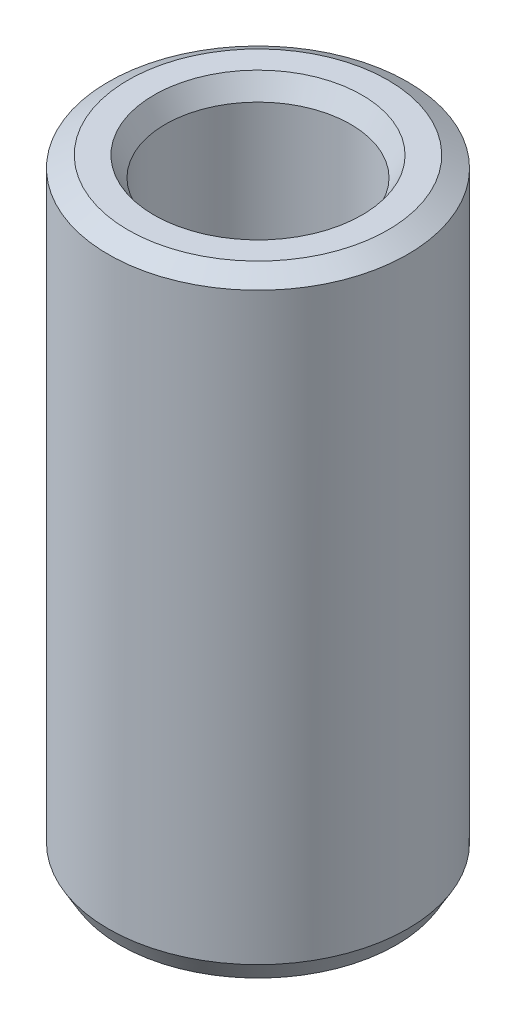
ISO-10303-21;
HEADER;
FILE_DESCRIPTION(('STEP AP214'),'2;1');
FILE_NAME('part.step','',(''),(''),'','','');
FILE_SCHEMA(('AUTOMOTIVE_DESIGN { 1 0 10303 214 1 1 1 1 }'));
ENDSEC;
DATA;
#1=APPLICATION_CONTEXT('core data for automotive mechanical design processes');
#2=APPLICATION_PROTOCOL_DEFINITION('international standard','automotive_design',2000,#1);
#3=PRODUCT_CONTEXT('',#1,'mechanical');
#4=PRODUCT('Part','Part','',(#3));
#5=PRODUCT_RELATED_PRODUCT_CATEGORY('part','',(#4));
#6=PRODUCT_DEFINITION_FORMATION('','',#4);
#7=PRODUCT_DEFINITION_CONTEXT('part definition',#1,'design');
#8=PRODUCT_DEFINITION('design','',#6,#7);
#9=PRODUCT_DEFINITION_SHAPE('','',#8);
#10=(LENGTH_UNIT() NAMED_UNIT(*) SI_UNIT(.MILLI.,.METRE.));
#11=(NAMED_UNIT(*) PLANE_ANGLE_UNIT() SI_UNIT($,.RADIAN.));
#12=(NAMED_UNIT(*) SI_UNIT($,.STERADIAN.) SOLID_ANGLE_UNIT());
#13=UNCERTAINTY_MEASURE_WITH_UNIT(LENGTH_MEASURE(1.E-05),#10,'distance_accuracy_value','');
#14=(GEOMETRIC_REPRESENTATION_CONTEXT(3) GLOBAL_UNCERTAINTY_ASSIGNED_CONTEXT((#13)) GLOBAL_UNIT_ASSIGNED_CONTEXT((#10,
#11,#12)) REPRESENTATION_CONTEXT('',''));
#15=CARTESIAN_POINT('',(0.,0.,0.));
#16=DIRECTION('',(0.,0.,1.));
#17=DIRECTION('',(1.,0.,0.));
#18=AXIS2_PLACEMENT_3D('',#15,#16,#17);
#19=CARTESIAN_POINT('',(0.,195.296196786765,0.));
#20=DIRECTION('',(0.,-1.,0.));
#21=DIRECTION('',(0.,0.,-1.));
#22=AXIS2_PLACEMENT_3D('',#19,#20,#21);
#23=CYLINDRICAL_SURFACE('',#22,47.5);
#24=CARTESIAN_POINT('',(0.,6.24265439849864,0.));
#25=DIRECTION('',(0.,1.,0.));
#26=DIRECTION('',(0.,0.,1.));
#27=AXIS2_PLACEMENT_3D('',#24,#25,#26);
#28=CIRCLE('',#27,47.5);
#29=CARTESIAN_POINT('',(0.,6.24265439849864,47.5));
#30=VERTEX_POINT('',#29);
#31=EDGE_CURVE('E10',#30,#30,#28,.T.);
#32=ORIENTED_EDGE('',*,*,#31,.T.);
#33=EDGE_LOOP('',(#32));
#34=FACE_BOUND('',#33,.T.);
#35=CARTESIAN_POINT('',(0.,191.691998589334,0.));
#36=DIRECTION('',(0.,1.,0.));
#37=DIRECTION('',(0.,0.,1.));
#38=AXIS2_PLACEMENT_3D('',#35,#36,#37);
#39=CIRCLE('',#38,47.5);
#40=CARTESIAN_POINT('',(0.,191.691998589334,-47.5));
#41=VERTEX_POINT('',#40);
#42=EDGE_CURVE('E50',#41,#41,#39,.F.);
#43=ORIENTED_EDGE('',*,*,#42,.T.);
#44=EDGE_LOOP('',(#43));
#45=FACE_BOUND('',#44,.T.);
#46=ADVANCED_FACE('F39',(#34,#45),#23,.T.);
#47=CARTESIAN_POINT('',(0.,195.296196786765,0.));
#48=DIRECTION('',(0.,1.,0.));
#49=DIRECTION('',(0.,0.,1.));
#50=AXIS2_PLACEMENT_3D('',#47,#48,#49);
#51=PLANE('',#50);
#52=CARTESIAN_POINT('',(0.,195.296196786765,0.));
#53=DIRECTION('',(0.,1.,0.));
#54=DIRECTION('',(0.,0.,1.));
#55=AXIS2_PLACEMENT_3D('',#52,#53,#54);
#56=CIRCLE('',#55,33.0271167062951);
#57=CARTESIAN_POINT('',(0.,195.296196786765,33.0271167062951));
#58=VERTEX_POINT('',#57);
#59=EDGE_CURVE('E58',#58,#58,#56,.F.);
#60=ORIENTED_EDGE('',*,*,#59,.T.);
#61=EDGE_LOOP('',(#60));
#62=FACE_BOUND('',#61,.T.);
#63=CARTESIAN_POINT('',(0.,195.296196786765,0.));
#64=DIRECTION('',(0.,1.,0.));
#65=DIRECTION('',(0.,0.,1.));
#66=AXIS2_PLACEMENT_3D('',#63,#64,#65);
#67=CIRCLE('',#66,41.2573456015013);
#68=CARTESIAN_POINT('',(0.,195.296196786765,-41.2573456015013));
#69=VERTEX_POINT('',#68);
#70=EDGE_CURVE('E61',#69,#69,#67,.T.);
#71=ORIENTED_EDGE('',*,*,#70,.T.);
#72=EDGE_LOOP('',(#71));
#73=FACE_BOUND('',#72,.T.);
#74=ADVANCED_FACE('F88',(#62,#73),#51,.T.);
#75=CARTESIAN_POINT('',(0.,0.,0.));
#76=DIRECTION('',(0.,1.,0.));
#77=DIRECTION('',(0.,0.,1.));
#78=AXIS2_PLACEMENT_3D('',#75,#76,#77);
#79=PLANE('',#78);
#80=CARTESIAN_POINT('',(0.,0.,0.));
#81=DIRECTION('',(0.,1.,0.));
#82=DIRECTION('',(0.,0.,1.));
#83=AXIS2_PLACEMENT_3D('',#80,#81,#82);
#84=CIRCLE('',#83,35.6655729073627);
#85=CARTESIAN_POINT('',(0.,0.,-35.6655729073627));
#86=VERTEX_POINT('',#85);
#87=EDGE_CURVE('E51',#86,#86,#84,.T.);
#88=ORIENTED_EDGE('',*,*,#87,.T.);
#89=EDGE_LOOP('',(#88));
#90=FACE_BOUND('',#89,.T.);
#91=CARTESIAN_POINT('',(0.,0.,0.));
#92=DIRECTION('',(0.,1.,0.));
#93=DIRECTION('',(0.,0.,1.));
#94=AXIS2_PLACEMENT_3D('',#91,#92,#93);
#95=CIRCLE('',#94,43.895801802569);
#96=CARTESIAN_POINT('',(0.,0.,43.895801802569));
#97=VERTEX_POINT('',#96);
#98=EDGE_CURVE('E54',#97,#97,#95,.F.);
#99=ORIENTED_EDGE('',*,*,#98,.T.);
#100=EDGE_LOOP('',(#99));
#101=FACE_BOUND('',#100,.T.);
#102=ADVANCED_FACE('F83',(#90,#101),#79,.F.);
#103=CARTESIAN_POINT('',(0.,195.296196786765,0.));
#104=DIRECTION('',(0.,-1.,0.));
#105=DIRECTION('',(0.,0.,-1.));
#106=AXIS2_PLACEMENT_3D('',#103,#104,#105);
#107=CYLINDRICAL_SURFACE('',#106,29.422918508864);
#108=CARTESIAN_POINT('',(0.,189.053542388266,0.));
#109=DIRECTION('',(0.,1.,0.));
#110=DIRECTION('',(0.,0.,1.));
#111=AXIS2_PLACEMENT_3D('',#108,#109,#110);
#112=CIRCLE('',#111,29.422918508864);
#113=CARTESIAN_POINT('',(0.,189.053542388266,-29.422918508864));
#114=VERTEX_POINT('',#113);
#115=EDGE_CURVE('E67',#114,#114,#112,.T.);
#116=CARTESIAN_POINT('',(0.,3.60419819743107,0.));
#117=DIRECTION('',(0.,1.,0.));
#118=DIRECTION('',(0.,0.,1.));
#119=AXIS2_PLACEMENT_3D('',#116,#117,#118);
#120=CIRCLE('',#119,29.422918508864);
#121=CARTESIAN_POINT('',(0.,3.60419819743107,-29.422918508864));
#122=VERTEX_POINT('',#121);
#123=EDGE_CURVE('E69',#122,#122,#120,.F.);
#124=CARTESIAN_POINT('',(0.,189.053542388266,-29.422918508864));
#125=CARTESIAN_POINT('',(0.,187.121778386278,-29.422918508864));
#126=CARTESIAN_POINT('',(0.,185.19001438429,-29.422918508864));
#127=CARTESIAN_POINT('',(0.,181.326486380315,-29.422918508864));
#128=CARTESIAN_POINT('',(0.,179.394722378327,-29.422918508864));
#129=CARTESIAN_POINT('',(0.,175.531194374351,-29.422918508864));
#130=CARTESIAN_POINT('',(0.,173.599430372363,-29.422918508864));
#131=CARTESIAN_POINT('',(0.,169.735902368387,-29.422918508864));
#132=CARTESIAN_POINT('',(0.,167.804138366399,-29.422918508864));
#133=CARTESIAN_POINT('',(0.,163.940610362424,-29.422918508864));
#134=CARTESIAN_POINT('',(0.,162.008846360436,-29.422918508864));
#135=CARTESIAN_POINT('',(0.,158.14531835646,-29.422918508864));
#136=CARTESIAN_POINT('',(0.,156.213554354472,-29.422918508864));
#137=CARTESIAN_POINT('',(0.,152.350026350497,-29.422918508864));
#138=CARTESIAN_POINT('',(0.,150.418262348509,-29.422918508864));
#139=CARTESIAN_POINT('',(0.,146.554734344533,-29.422918508864));
#140=CARTESIAN_POINT('',(0.,144.622970342545,-29.422918508864));
#141=CARTESIAN_POINT('',(0.,140.759442338569,-29.422918508864));
#142=CARTESIAN_POINT('',(0.,138.827678336582,-29.422918508864));
#143=CARTESIAN_POINT('',(0.,134.964150332606,-29.422918508864));
#144=CARTESIAN_POINT('',(0.,133.032386330618,-29.422918508864));
#145=CARTESIAN_POINT('',(0.,129.168858326642,-29.422918508864));
#146=CARTESIAN_POINT('',(0.,127.237094324654,-29.422918508864));
#147=CARTESIAN_POINT('',(0.,123.373566320679,-29.422918508864));
#148=CARTESIAN_POINT('',(0.,121.441802318691,-29.422918508864));
#149=CARTESIAN_POINT('',(0.,117.578274314715,-29.422918508864));
#150=CARTESIAN_POINT('',(0.,115.646510312727,-29.422918508864));
#151=CARTESIAN_POINT('',(0.,111.782982308751,-29.422918508864));
#152=CARTESIAN_POINT('',(0.,109.851218306764,-29.422918508864));
#153=CARTESIAN_POINT('',(0.,105.987690302788,-29.422918508864));
#154=CARTESIAN_POINT('',(0.,104.0559263008,-29.422918508864));
#155=CARTESIAN_POINT('',(0.,100.192398296824,-29.422918508864));
#156=CARTESIAN_POINT('',(0.,98.2606342948364,-29.422918508864));
#157=CARTESIAN_POINT('',(0.,94.3971062908606,-29.422918508864));
#158=CARTESIAN_POINT('',(0.,92.4653422888728,-29.422918508864));
#159=CARTESIAN_POINT('',(0.,88.6018142848971,-29.422918508864));
#160=CARTESIAN_POINT('',(0.,86.6700502829092,-29.422918508864));
#161=CARTESIAN_POINT('',(0.,82.8065222789335,-29.422918508864));
#162=CARTESIAN_POINT('',(0.,80.8747582769456,-29.422918508864));
#163=CARTESIAN_POINT('',(0.,77.0112302729699,-29.422918508864));
#164=CARTESIAN_POINT('',(0.,75.079466270982,-29.422918508864));
#165=CARTESIAN_POINT('',(0.,71.2159382670063,-29.422918508864));
#166=CARTESIAN_POINT('',(0.,69.2841742650184,-29.422918508864));
#167=CARTESIAN_POINT('',(0.,65.4206462610427,-29.422918508864));
#168=CARTESIAN_POINT('',(0.,63.4888822590549,-29.422918508864));
#169=CARTESIAN_POINT('',(0.,59.6253542550791,-29.422918508864));
#170=CARTESIAN_POINT('',(0.,57.6935902530913,-29.422918508864));
#171=CARTESIAN_POINT('',(0.,53.8300622491155,-29.422918508864));
#172=CARTESIAN_POINT('',(0.,51.8982982471277,-29.422918508864));
#173=CARTESIAN_POINT('',(0.,48.0347702431519,-29.422918508864));
#174=CARTESIAN_POINT('',(0.,46.1030062411641,-29.422918508864));
#175=CARTESIAN_POINT('',(0.,42.2394782371883,-29.422918508864));
#176=CARTESIAN_POINT('',(0.,40.3077142352005,-29.422918508864));
#177=CARTESIAN_POINT('',(0.,36.4441862312247,-29.422918508864));
#178=CARTESIAN_POINT('',(0.,34.5124222292369,-29.422918508864));
#179=CARTESIAN_POINT('',(0.,30.6488942252612,-29.422918508864));
#180=CARTESIAN_POINT('',(0.,28.7171302232733,-29.422918508864));
#181=CARTESIAN_POINT('',(0.,24.8536022192976,-29.422918508864));
#182=CARTESIAN_POINT('',(0.,22.9218382173097,-29.422918508864));
#183=CARTESIAN_POINT('',(0.,19.058310213334,-29.422918508864));
#184=CARTESIAN_POINT('',(0.,17.1265462113461,-29.422918508864));
#185=CARTESIAN_POINT('',(0.,13.2630182073704,-29.422918508864));
#186=CARTESIAN_POINT('',(0.,11.3312542053825,-29.422918508864));
#187=CARTESIAN_POINT('',(0.,7.46772620140679,-29.422918508864));
#188=CARTESIAN_POINT('',(0.,5.53596219941893,-29.422918508864));
#189=CARTESIAN_POINT('',(0.,3.60419819743107,-29.422918508864));
#190=B_SPLINE_CURVE_WITH_KNOTS('',3,(#124,#125,#126,#127,#128,#129,#130,#131,#132,#133,#134,
#135,#136,#137,#138,#139,#140,#141,#142,#143,#144,#145,#146,#147,#148,#149,#150,#151,#152,#153,
#154,#155,#156,#157,#158,#159,#160,#161,#162,#163,#164,#165,#166,#167,#168,#169,#170,#171,#172,
#173,#174,#175,#176,#177,#178,#179,#180,#181,#182,#183,#184,#185,#186,#187,#188,#189),
.UNSPECIFIED.,.F.,.F.,(4,2,2,2,2,2,2,2,2,2,2,2,2,2,2,2,2,2,2,2,2,2,2,2,2,2,2,2,2,2,2,2,4),(0.,
5.7952920059636,11.5905840119272,17.3858760178908,23.1811680238544,28.976460029818,
34.7717520357816,40.5670440417452,46.3623360477087,52.1576280536723,57.9529200596359,
63.7482120655995,69.5435040715631,75.3387960775267,81.1340880834903,86.9293800894539,
92.7246720954175,98.5199641013811,104.315256107345,110.110548113308,115.905840119272,
121.701132125235,127.496424131199,133.291716137163,139.087008143126,144.88230014909,
150.677592155053,156.472884161017,162.268176166981,168.063468172944,173.858760178908,
179.654052184871,185.449344190835),.UNSPECIFIED.);
#191=EDGE_CURVE('BSEAM71',#114,#122,#190,.T.);
#192=ORIENTED_EDGE('',*,*,#115,.T.);
#193=ORIENTED_EDGE('',*,*,#123,.T.);
#194=ORIENTED_EDGE('',*,*,#191,.T.);
#195=ORIENTED_EDGE('',*,*,#191,.F.);
#196=EDGE_LOOP('',(#192,#194,#193,#195));
#197=FACE_BOUND('',#196,.T.);
#198=ADVANCED_FACE('F71',(#197),#107,.F.);
#199=CARTESIAN_POINT('',(0.,189.053542388266,0.));
#200=DIRECTION('',(0.,1.,0.));
#201=DIRECTION('',(0.,0.,1.));
#202=AXIS2_PLACEMENT_3D('',#199,#200,#201);
#203=CONICAL_SURFACE('',#202,29.422918508864,0.523598775598294);
#204=ORIENTED_EDGE('',*,*,#59,.F.);
#205=EDGE_LOOP('',(#204));
#206=FACE_BOUND('',#205,.T.);
#207=ORIENTED_EDGE('',*,*,#115,.F.);
#208=EDGE_LOOP('',(#207));
#209=FACE_BOUND('',#208,.T.);
#210=ADVANCED_FACE('F77',(#206,#209),#203,.F.);
#211=CARTESIAN_POINT('',(0.,0.,0.));
#212=DIRECTION('',(0.,-1.,0.));
#213=DIRECTION('',(0.,0.,-1.));
#214=AXIS2_PLACEMENT_3D('',#211,#212,#213);
#215=CONICAL_SURFACE('',#214,35.6655729073627,1.04719755119659);
#216=CARTESIAN_POINT('',(0.,3.60419819743107,-29.422918508864));
#217=CARTESIAN_POINT('',(0.,3.56665446620783,-29.4879461588484));
#218=CARTESIAN_POINT('',(0.,3.52911073498459,-29.5529738088327));
#219=CARTESIAN_POINT('',(0.,3.45402327253811,-29.6830291088015));
#220=CARTESIAN_POINT('',(0.,3.41647954131487,-29.7480567587858));
#221=CARTESIAN_POINT('',(0.,3.34139207886839,-29.8781120587545));
#222=CARTESIAN_POINT('',(0.,3.30384834764515,-29.9431397087389));
#223=CARTESIAN_POINT('',(0.,3.22876088519867,-30.0731950087076));
#224=CARTESIAN_POINT('',(0.,3.19121715397543,-30.138222658692));
#225=CARTESIAN_POINT('',(0.,3.11612969152895,-30.2682779586607));
#226=CARTESIAN_POINT('',(0.,3.07858596030571,-30.3333056086451));
#227=CARTESIAN_POINT('',(0.,3.00349849785923,-30.4633609086138));
#228=CARTESIAN_POINT('',(0.,2.96595476663599,-30.5283885585982));
#229=CARTESIAN_POINT('',(0.,2.89086730418951,-30.6584438585669));
#230=CARTESIAN_POINT('',(0.,2.85332357296627,-30.7234715085512));
#231=CARTESIAN_POINT('',(0.,2.77823611051979,-30.85352680852));
#232=CARTESIAN_POINT('',(0.,2.74069237929655,-30.9185544585043));
#233=CARTESIAN_POINT('',(0.,2.66560491685006,-31.0486097584731));
#234=CARTESIAN_POINT('',(0.,2.62806118562682,-31.1136374084574));
#235=CARTESIAN_POINT('',(0.,2.55297372318034,-31.2436927084261));
#236=CARTESIAN_POINT('',(0.,2.5154299919571,-31.3087203584105));
#237=CARTESIAN_POINT('',(0.,2.44034252951062,-31.4387756583792));
#238=CARTESIAN_POINT('',(0.,2.40279879828738,-31.5038033083636));
#239=CARTESIAN_POINT('',(0.,2.3277113358409,-31.6338586083323));
#240=CARTESIAN_POINT('',(0.,2.29016760461766,-31.6988862583167));
#241=CARTESIAN_POINT('',(0.,2.21508014217118,-31.8289415582854));
#242=CARTESIAN_POINT('',(0.,2.17753641094794,-31.8939692082698));
#243=CARTESIAN_POINT('',(0.,2.10244894850146,-32.0240245082385));
#244=CARTESIAN_POINT('',(0.,2.06490521727822,-32.0890521582228));
#245=CARTESIAN_POINT('',(0.,1.98981775483174,-32.2191074581916));
#246=CARTESIAN_POINT('',(0.,1.9522740236085,-32.2841351081759));
#247=CARTESIAN_POINT('',(0.,1.87718656116202,-32.4141904081446));
#248=CARTESIAN_POINT('',(0.,1.83964282993878,-32.479218058129));
#249=CARTESIAN_POINT('',(0.,1.7645553674923,-32.6092733580977));
#250=CARTESIAN_POINT('',(0.,1.72701163626906,-32.6743010080821));
#251=CARTESIAN_POINT('',(0.,1.65192417382258,-32.8043563080508));
#252=CARTESIAN_POINT('',(0.,1.61438044259933,-32.8693839580352));
#253=CARTESIAN_POINT('',(0.,1.53929298015285,-32.9994392580039));
#254=CARTESIAN_POINT('',(0.,1.50174924892961,-33.0644669079883));
#255=CARTESIAN_POINT('',(0.,1.42666178648313,-33.194522207957));
#256=CARTESIAN_POINT('',(0.,1.38911805525989,-33.2595498579413));
#257=CARTESIAN_POINT('',(0.,1.31403059281341,-33.3896051579101));
#258=CARTESIAN_POINT('',(0.,1.27648686159017,-33.4546328078944));
#259=CARTESIAN_POINT('',(0.,1.20139939914369,-33.5846881078632));
#260=CARTESIAN_POINT('',(0.,1.16385566792045,-33.6497157578475));
#261=CARTESIAN_POINT('',(0.,1.08876820547397,-33.7797710578162));
#262=CARTESIAN_POINT('',(0.,1.05122447425073,-33.8447987078006));
#263=CARTESIAN_POINT('',(0.,0.976137011804249,-33.9748540077693));
#264=CARTESIAN_POINT('',(0.,0.938593280581009,-34.0398816577537));
#265=CARTESIAN_POINT('',(0.,0.863505818134529,-34.1699369577224));
#266=CARTESIAN_POINT('',(0.,0.825962086911287,-34.2349646077068));
#267=CARTESIAN_POINT('',(0.,0.750874624464807,-34.3650199076755));
#268=CARTESIAN_POINT('',(0.,0.713330893241567,-34.4300475576599));
#269=CARTESIAN_POINT('',(0.,0.638243430795086,-34.5601028576286));
#270=CARTESIAN_POINT('',(0.,0.600699699571845,-34.6251305076129));
#271=CARTESIAN_POINT('',(0.,0.525612237125364,-34.7551858075817));
#272=CARTESIAN_POINT('',(0.,0.488068505902125,-34.820213457566));
#273=CARTESIAN_POINT('',(0.,0.412981043455644,-34.9502687575347));
#274=CARTESIAN_POINT('',(0.,0.375437312232403,-35.0152964075191));
#275=CARTESIAN_POINT('',(0.,0.300349849785922,-35.1453517074878));
#276=CARTESIAN_POINT('',(0.,0.262806118562683,-35.2103793574722));
#277=CARTESIAN_POINT('',(0.,0.187718656116202,-35.3404346574409));
#278=CARTESIAN_POINT('',(0.,0.150174924892962,-35.4054623074253));
#279=CARTESIAN_POINT('',(0.,0.0750874624464796,-35.535517607394));
#280=CARTESIAN_POINT('',(0.,0.0375437312232386,-35.6005452573784));
#281=CARTESIAN_POINT('',(0.,0.,-35.6655729073627));
#282=B_SPLINE_CURVE_WITH_KNOTS('',3,(#216,#217,#218,#219,#220,#221,#222,#223,#224,#225,#226,
#227,#228,#229,#230,#231,#232,#233,#234,#235,#236,#237,#238,#239,#240,#241,#242,#243,#244,#245,
#246,#247,#248,#249,#250,#251,#252,#253,#254,#255,#256,#257,#258,#259,#260,#261,#262,#263,#264,
#265,#266,#267,#268,#269,#270,#271,#272,#273,#274,#275,#276,#277,#278,#279,#280,#281),
.UNSPECIFIED.,.F.,.F.,(4,2,2,2,2,2,2,2,2,2,2,2,2,2,2,2,2,2,2,2,2,2,2,2,2,2,2,2,2,2,2,2,4),(0.,
0.22526238733944,0.450524774678879,0.675787162018319,0.901049549357759,1.1263119366972,
1.35157432403664,1.57683671137608,1.80209909871552,2.02736148605496,2.2526238733944,
2.47788626073384,2.70314864807328,2.92841103541272,3.15367342275216,3.3789358100916,
3.60419819743104,3.82946058477048,4.05472297210992,4.27998535944936,4.5052477467888,
4.73051013412824,4.95577252146768,5.18103490880712,5.40629729614656,5.631559683486,
5.85682207082544,6.08208445816488,6.30734684550432,6.53260923284376,6.7578716201832,
6.98313400752264,7.20839639486208),.UNSPECIFIED.);
#283=EDGE_CURVE('BSEAM73',#122,#86,#282,.T.);
#284=ORIENTED_EDGE('',*,*,#123,.F.);
#285=ORIENTED_EDGE('',*,*,#87,.F.);
#286=ORIENTED_EDGE('',*,*,#283,.T.);
#287=ORIENTED_EDGE('',*,*,#283,.F.);
#288=EDGE_LOOP('',(#284,#286,#285,#287));
#289=FACE_BOUND('',#288,.T.);
#290=ADVANCED_FACE('F73',(#289),#215,.F.);
#291=CARTESIAN_POINT('',(0.,6.24265439849864,0.));
#292=DIRECTION('',(0.,1.,0.));
#293=DIRECTION('',(0.,0.,1.));
#294=AXIS2_PLACEMENT_3D('',#291,#292,#293);
#295=CONICAL_SURFACE('',#294,47.5,0.523598775598303);
#296=ORIENTED_EDGE('',*,*,#98,.F.);
#297=EDGE_LOOP('',(#296));
#298=FACE_BOUND('',#297,.T.);
#299=ORIENTED_EDGE('',*,*,#31,.F.);
#300=EDGE_LOOP('',(#299));
#301=FACE_BOUND('',#300,.T.);
#302=ADVANCED_FACE('F76',(#298,#301),#295,.T.);
#303=CARTESIAN_POINT('',(0.,195.296196786765,0.));
#304=DIRECTION('',(0.,-1.,0.));
#305=DIRECTION('',(0.,0.,-1.));
#306=AXIS2_PLACEMENT_3D('',#303,#304,#305);
#307=CONICAL_SURFACE('',#306,41.2573456015013,1.04719755119659);
#308=CARTESIAN_POINT('',(0.,191.691998589334,-47.5));
#309=CARTESIAN_POINT('',(0.,191.729542320557,-47.4349723500157));
#310=CARTESIAN_POINT('',(0.,191.76708605178,-47.3699447000313));
#311=CARTESIAN_POINT('',(0.,191.842173514227,-47.2398894000626));
#312=CARTESIAN_POINT('',(0.,191.87971724545,-47.1748617500782));
#313=CARTESIAN_POINT('',(0.,191.954804707896,-47.0448064501095));
#314=CARTESIAN_POINT('',(0.,191.99234843912,-46.9797788001251));
#315=CARTESIAN_POINT('',(0.,192.067435901566,-46.8497235001564));
#316=CARTESIAN_POINT('',(0.,192.104979632789,-46.784695850172));
#317=CARTESIAN_POINT('',(0.,192.180067095236,-46.6546405502033));
#318=CARTESIAN_POINT('',(0.,192.217610826459,-46.589612900219));
#319=CARTESIAN_POINT('',(0.,192.292698288906,-46.4595576002502));
#320=CARTESIAN_POINT('',(0.,192.330242020129,-46.3945299502659));
#321=CARTESIAN_POINT('',(0.,192.405329482575,-46.2644746502972));
#322=CARTESIAN_POINT('',(0.,192.442873213799,-46.1994470003128));
#323=CARTESIAN_POINT('',(0.,192.517960676245,-46.0693917003441));
#324=CARTESIAN_POINT('',(0.,192.555504407468,-46.0043640503597));
#325=CARTESIAN_POINT('',(0.,192.630591869915,-45.874308750391));
#326=CARTESIAN_POINT('',(0.,192.668135601138,-45.8092811004066));
#327=CARTESIAN_POINT('',(0.,192.743223063585,-45.6792258004379));
#328=CARTESIAN_POINT('',(0.,192.780766794808,-45.6141981504535));
#329=CARTESIAN_POINT('',(0.,192.855854257254,-45.4841428504848));
#330=CARTESIAN_POINT('',(0.,192.893397988477,-45.4191152005005));
#331=CARTESIAN_POINT('',(0.,192.968485450924,-45.2890599005317));
#332=CARTESIAN_POINT('',(0.,193.006029182147,-45.2240322505474));
#333=CARTESIAN_POINT('',(0.,193.081116644594,-45.0939769505787));
#334=CARTESIAN_POINT('',(0.,193.118660375817,-45.0289493005943));
#335=CARTESIAN_POINT('',(0.,193.193747838263,-44.8988940006256));
#336=CARTESIAN_POINT('',(0.,193.231291569487,-44.8338663506412));
#337=CARTESIAN_POINT('',(0.,193.306379031933,-44.7038110506725));
#338=CARTESIAN_POINT('',(0.,193.343922763156,-44.6387834006881));
#339=CARTESIAN_POINT('',(0.,193.419010225603,-44.5087281007194));
#340=CARTESIAN_POINT('',(0.,193.456553956826,-44.443700450735));
#341=CARTESIAN_POINT('',(0.,193.531641419273,-44.3136451507663));
#342=CARTESIAN_POINT('',(0.,193.569185150496,-44.248617500782));
#343=CARTESIAN_POINT('',(0.,193.644272612942,-44.1185622008132));
#344=CARTESIAN_POINT('',(0.,193.681816344166,-44.0535345508289));
#345=CARTESIAN_POINT('',(0.,193.756903806612,-43.9234792508601));
#346=CARTESIAN_POINT('',(0.,193.794447537835,-43.8584516008758));
#347=CARTESIAN_POINT('',(0.,193.869535000282,-43.7283963009071));
#348=CARTESIAN_POINT('',(0.,193.907078731505,-43.6633686509227));
#349=CARTESIAN_POINT('',(0.,193.982166193951,-43.533313350954));
#350=CARTESIAN_POINT('',(0.,194.019709925175,-43.4682857009696));
#351=CARTESIAN_POINT('',(0.,194.094797387621,-43.3382304010009));
#352=CARTESIAN_POINT('',(0.,194.132341118844,-43.2732027510165));
#353=CARTESIAN_POINT('',(0.,194.207428581291,-43.1431474510478));
#354=CARTESIAN_POINT('',(0.,194.244972312514,-43.0781198010634));
#355=CARTESIAN_POINT('',(0.,194.320059774961,-42.9480645010947));
#356=CARTESIAN_POINT('',(0.,194.357603506184,-42.8830368511104));
#357=CARTESIAN_POINT('',(0.,194.43269096863,-42.7529815511416));
#358=CARTESIAN_POINT('',(0.,194.470234699854,-42.6879539011573));
#359=CARTESIAN_POINT('',(0.,194.5453221623,-42.5578986011886));
#360=CARTESIAN_POINT('',(0.,194.582865893523,-42.4928709512042));
#361=CARTESIAN_POINT('',(0.,194.65795335597,-42.3628156512355));
#362=CARTESIAN_POINT('',(0.,194.695497087193,-42.2977880012511));
#363=CARTESIAN_POINT('',(0.,194.77058454964,-42.1677327012824));
#364=CARTESIAN_POINT('',(0.,194.808128280863,-42.102705051298));
#365=CARTESIAN_POINT('',(0.,194.883215743309,-41.9726497513293));
#366=CARTESIAN_POINT('',(0.,194.920759474533,-41.9076221013449));
#367=CARTESIAN_POINT('',(0.,194.995846936979,-41.7775668013762));
#368=CARTESIAN_POINT('',(0.,195.033390668202,-41.7125391513919));
#369=CARTESIAN_POINT('',(0.,195.108478130649,-41.5824838514231));
#370=CARTESIAN_POINT('',(0.,195.146021861872,-41.5174562014388));
#371=CARTESIAN_POINT('',(0.,195.221109324318,-41.38740090147));
#372=CARTESIAN_POINT('',(0.,195.258653055542,-41.3223732514857));
#373=CARTESIAN_POINT('',(0.,195.296196786765,-41.2573456015013));
#374=B_SPLINE_CURVE_WITH_KNOTS('',3,(#308,#309,#310,#311,#312,#313,#314,#315,#316,#317,#318,
#319,#320,#321,#322,#323,#324,#325,#326,#327,#328,#329,#330,#331,#332,#333,#334,#335,#336,#337,
#338,#339,#340,#341,#342,#343,#344,#345,#346,#347,#348,#349,#350,#351,#352,#353,#354,#355,#356,
#357,#358,#359,#360,#361,#362,#363,#364,#365,#366,#367,#368,#369,#370,#371,#372,#373),
.UNSPECIFIED.,.F.,.F.,(4,2,2,2,2,2,2,2,2,2,2,2,2,2,2,2,2,2,2,2,2,2,2,2,2,2,2,2,2,2,2,2,4),(0.,
0.225262387339443,0.450524774678879,0.675787162018322,0.901049549357765,1.1263119366972,
1.35157432403664,1.57683671137608,1.80209909871552,2.02736148605497,2.2526238733944,
2.47788626073385,2.7031486480733,2.92841103541274,3.15367342275218,3.3789358100916,
3.60419819743105,3.82946058477048,4.05472297210993,4.27998535944937,4.50524774678881,
4.73051013412825,4.95577252146769,5.18103490880713,5.40629729614659,5.63155968348602,
5.85682207082547,6.08208445816491,6.30734684550435,6.53260923284379,6.75787162018323,
6.98313400752267,7.20839639486211),.UNSPECIFIED.);
#375=EDGE_CURVE('BSEAM45',#41,#69,#374,.T.);
#376=ORIENTED_EDGE('',*,*,#42,.F.);
#377=ORIENTED_EDGE('',*,*,#70,.F.);
#378=ORIENTED_EDGE('',*,*,#375,.T.);
#379=ORIENTED_EDGE('',*,*,#375,.F.);
#380=EDGE_LOOP('',(#376,#378,#377,#379));
#381=FACE_BOUND('',#380,.T.);
#382=ADVANCED_FACE('F45',(#381),#307,.T.);
#383=CLOSED_SHELL('',(#46,#74,#102,#198,#210,#290,#302,#382));
#384=MANIFOLD_SOLID_BREP('B2',#383);
#385=ADVANCED_BREP_SHAPE_REPRESENTATION('',(#18,#384),#14);
#386=SHAPE_DEFINITION_REPRESENTATION(#9,#385);
ENDSEC;
END-ISO-10303-21;
